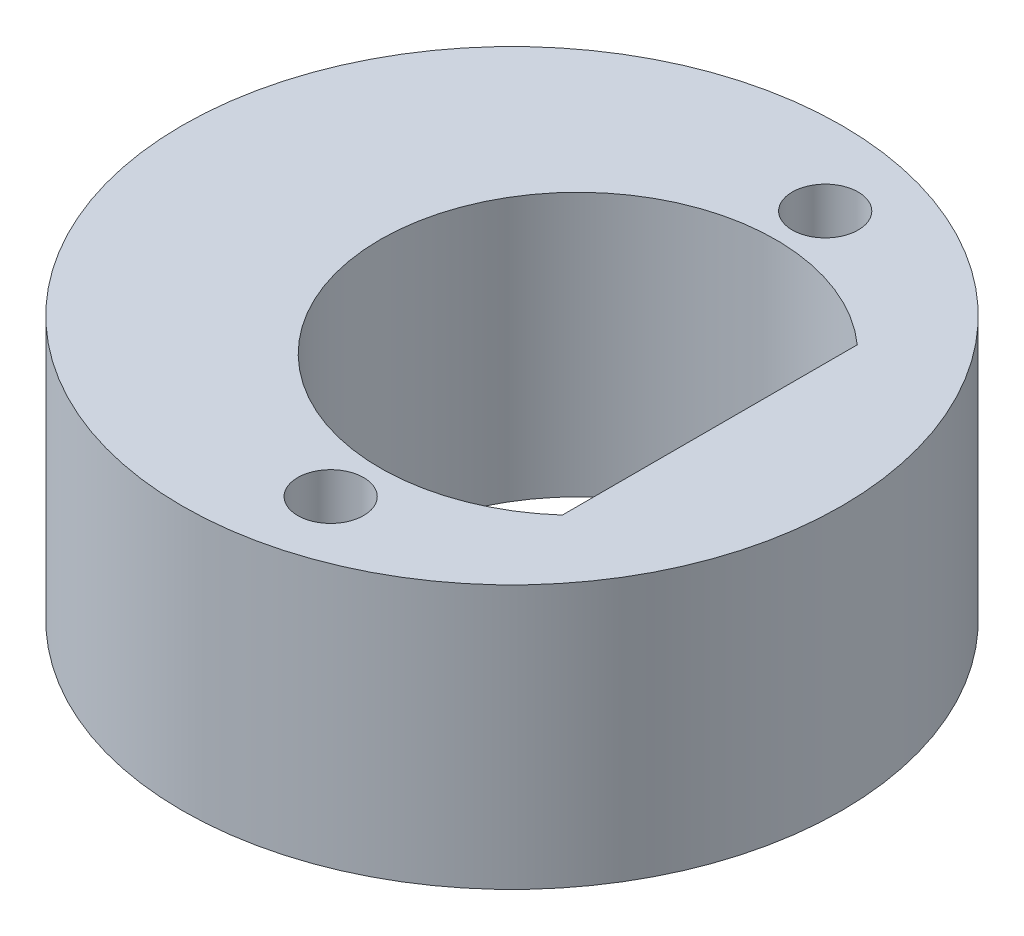
ISO-10303-21;
HEADER;
FILE_DESCRIPTION(('STEP AP214'),'2;1');
FILE_NAME('part.step','',(''),(''),'','','');
FILE_SCHEMA(('AUTOMOTIVE_DESIGN { 1 0 10303 214 1 1 1 1 }'));
ENDSEC;
DATA;
#1=APPLICATION_CONTEXT('core data for automotive mechanical design processes');
#2=APPLICATION_PROTOCOL_DEFINITION('international standard','automotive_design',2000,#1);
#3=PRODUCT_CONTEXT('',#1,'mechanical');
#4=PRODUCT('Part','Part','',(#3));
#5=PRODUCT_RELATED_PRODUCT_CATEGORY('part','',(#4));
#6=PRODUCT_DEFINITION_FORMATION('','',#4);
#7=PRODUCT_DEFINITION_CONTEXT('part definition',#1,'design');
#8=PRODUCT_DEFINITION('design','',#6,#7);
#9=PRODUCT_DEFINITION_SHAPE('','',#8);
#10=(LENGTH_UNIT() NAMED_UNIT(*) SI_UNIT(.MILLI.,.METRE.));
#11=(NAMED_UNIT(*) PLANE_ANGLE_UNIT() SI_UNIT($,.RADIAN.));
#12=(NAMED_UNIT(*) SI_UNIT($,.STERADIAN.) SOLID_ANGLE_UNIT());
#13=UNCERTAINTY_MEASURE_WITH_UNIT(LENGTH_MEASURE(1.E-05),#10,'distance_accuracy_value','');
#14=(GEOMETRIC_REPRESENTATION_CONTEXT(3) GLOBAL_UNCERTAINTY_ASSIGNED_CONTEXT((#13)) GLOBAL_UNIT_ASSIGNED_CONTEXT((#10,
#11,#12)) REPRESENTATION_CONTEXT('',''));
#15=CARTESIAN_POINT('',(0.,0.,0.));
#16=DIRECTION('',(0.,0.,1.));
#17=DIRECTION('',(1.,0.,0.));
#18=AXIS2_PLACEMENT_3D('',#15,#16,#17);
#19=CARTESIAN_POINT('',(-1.,4.,0.));
#20=DIRECTION('',(0.,1.,0.));
#21=DIRECTION('',(0.,0.,1.));
#22=AXIS2_PLACEMENT_3D('',#19,#20,#21);
#23=PLANE('',#22);
#24=CARTESIAN_POINT('',(0.,4.,-3.75));
#25=DIRECTION('',(0.,1.,0.));
#26=DIRECTION('',(0.,0.,1.));
#27=AXIS2_PLACEMENT_3D('',#24,#25,#26);
#28=CIRCLE('',#27,0.5);
#29=CARTESIAN_POINT('',(0.,4.,-3.25));
#30=VERTEX_POINT('',#29);
#31=EDGE_CURVE('E81',#30,#30,#28,.T.);
#32=ORIENTED_EDGE('',*,*,#31,.F.);
#33=EDGE_LOOP('',(#32));
#34=FACE_BOUND('',#33,.T.);
#35=CARTESIAN_POINT('',(0.,4.,3.75));
#36=DIRECTION('',(0.,1.,0.));
#37=DIRECTION('',(0.,0.,1.));
#38=AXIS2_PLACEMENT_3D('',#35,#36,#37);
#39=CIRCLE('',#38,0.5);
#40=CARTESIAN_POINT('',(0.,4.,4.25));
#41=VERTEX_POINT('',#40);
#42=EDGE_CURVE('E84',#41,#41,#39,.T.);
#43=ORIENTED_EDGE('',*,*,#42,.F.);
#44=EDGE_LOOP('',(#43));
#45=FACE_BOUND('',#44,.T.);
#46=CARTESIAN_POINT('',(-1.,4.,0.));
#47=DIRECTION('',(0.,1.,0.));
#48=DIRECTION('',(0.,0.,1.));
#49=AXIS2_PLACEMENT_3D('',#46,#47,#48);
#50=CIRCLE('',#49,5.);
#51=CARTESIAN_POINT('',(-1.,4.,5.));
#52=VERTEX_POINT('',#51);
#53=EDGE_CURVE('E11',#52,#52,#50,.T.);
#54=ORIENTED_EDGE('',*,*,#53,.T.);
#55=EDGE_LOOP('',(#54));
#56=FACE_BOUND('',#55,.T.);
#57=CARTESIAN_POINT('',(0.,4.,0.));
#58=DIRECTION('',(0.,1.,0.));
#59=DIRECTION('',(0.,0.,1.));
#60=AXIS2_PLACEMENT_3D('',#57,#58,#59);
#61=CIRCLE('',#60,3.);
#62=CARTESIAN_POINT('',(2.,4.,-2.23606797749979));
#63=VERTEX_POINT('',#62);
#64=CARTESIAN_POINT('',(2.,4.,2.23606797749979));
#65=VERTEX_POINT('',#64);
#66=EDGE_CURVE('E74',#63,#65,#61,.T.);
#67=ORIENTED_EDGE('',*,*,#66,.F.);
#68=DIRECTION('',(0.,0.,-1.));
#69=VECTOR('',#68,1.);
#70=CARTESIAN_POINT('',(2.,4.,0.));
#71=LINE('',#70,#69);
#72=EDGE_CURVE('E59',#65,#63,#71,.T.);
#73=ORIENTED_EDGE('',*,*,#72,.F.);
#74=EDGE_LOOP('',(#67,#73));
#75=FACE_BOUND('',#74,.T.);
#76=ADVANCED_FACE('F37',(#34,#45,#56,#75),#23,.T.);
#77=CARTESIAN_POINT('',(-1.,0.,0.));
#78=DIRECTION('',(0.,1.,0.));
#79=DIRECTION('',(0.,0.,1.));
#80=AXIS2_PLACEMENT_3D('',#77,#78,#79);
#81=PLANE('',#80);
#82=CARTESIAN_POINT('',(0.,0.,-3.75));
#83=DIRECTION('',(0.,1.,0.));
#84=DIRECTION('',(0.,0.,1.));
#85=AXIS2_PLACEMENT_3D('',#82,#83,#84);
#86=CIRCLE('',#85,0.5);
#87=CARTESIAN_POINT('',(0.,0.,-3.25));
#88=VERTEX_POINT('',#87);
#89=EDGE_CURVE('E77',#88,#88,#86,.T.);
#90=ORIENTED_EDGE('',*,*,#89,.T.);
#91=EDGE_LOOP('',(#90));
#92=FACE_BOUND('',#91,.T.);
#93=CARTESIAN_POINT('',(0.,0.,3.75));
#94=DIRECTION('',(0.,1.,0.));
#95=DIRECTION('',(0.,0.,1.));
#96=AXIS2_PLACEMENT_3D('',#93,#94,#95);
#97=CIRCLE('',#96,0.5);
#98=CARTESIAN_POINT('',(0.,0.,4.25));
#99=VERTEX_POINT('',#98);
#100=EDGE_CURVE('E87',#99,#99,#97,.T.);
#101=ORIENTED_EDGE('',*,*,#100,.T.);
#102=EDGE_LOOP('',(#101));
#103=FACE_BOUND('',#102,.T.);
#104=CARTESIAN_POINT('',(-1.,0.,0.));
#105=DIRECTION('',(0.,1.,0.));
#106=DIRECTION('',(0.,0.,1.));
#107=AXIS2_PLACEMENT_3D('',#104,#105,#106);
#108=CIRCLE('',#107,5.);
#109=CARTESIAN_POINT('',(-1.,0.,5.));
#110=VERTEX_POINT('',#109);
#111=EDGE_CURVE('E41',#110,#110,#108,.T.);
#112=ORIENTED_EDGE('',*,*,#111,.F.);
#113=EDGE_LOOP('',(#112));
#114=FACE_BOUND('',#113,.T.);
#115=CARTESIAN_POINT('',(0.,0.,0.));
#116=DIRECTION('',(0.,1.,0.));
#117=DIRECTION('',(0.,0.,1.));
#118=AXIS2_PLACEMENT_3D('',#115,#116,#117);
#119=CIRCLE('',#118,3.);
#120=CARTESIAN_POINT('',(2.,0.,-2.23606797749979));
#121=VERTEX_POINT('',#120);
#122=CARTESIAN_POINT('',(2.,0.,2.23606797749979));
#123=VERTEX_POINT('',#122);
#124=EDGE_CURVE('E72',#121,#123,#119,.T.);
#125=ORIENTED_EDGE('',*,*,#124,.T.);
#126=DIRECTION('',(0.,0.,-1.));
#127=VECTOR('',#126,1.);
#128=CARTESIAN_POINT('',(2.,0.,0.));
#129=LINE('',#128,#127);
#130=EDGE_CURVE('E51',#123,#121,#129,.T.);
#131=ORIENTED_EDGE('',*,*,#130,.T.);
#132=EDGE_LOOP('',(#125,#131));
#133=FACE_BOUND('',#132,.T.);
#134=ADVANCED_FACE('F76',(#92,#103,#114,#133),#81,.F.);
#135=CARTESIAN_POINT('',(-1.,4.,0.));
#136=DIRECTION('',(0.,-1.,0.));
#137=DIRECTION('',(0.,0.,-1.));
#138=AXIS2_PLACEMENT_3D('',#135,#136,#137);
#139=CYLINDRICAL_SURFACE('',#138,5.);
#140=ORIENTED_EDGE('',*,*,#53,.F.);
#141=EDGE_LOOP('',(#140));
#142=FACE_BOUND('',#141,.T.);
#143=ORIENTED_EDGE('',*,*,#111,.T.);
#144=EDGE_LOOP('',(#143));
#145=FACE_BOUND('',#144,.T.);
#146=ADVANCED_FACE('F39',(#142,#145),#139,.T.);
#147=CARTESIAN_POINT('',(0.,4.,0.));
#148=DIRECTION('',(0.,-1.,0.));
#149=DIRECTION('',(0.,0.,-1.));
#150=AXIS2_PLACEMENT_3D('',#147,#148,#149);
#151=CYLINDRICAL_SURFACE('',#150,3.);
#152=DIRECTION('',(0.,-1.,0.));
#153=VECTOR('',#152,1.);
#154=CARTESIAN_POINT('',(2.,4.,-2.23606797749979));
#155=LINE('',#154,#153);
#156=EDGE_CURVE('E66',#63,#121,#155,.T.);
#157=ORIENTED_EDGE('',*,*,#156,.F.);
#158=ORIENTED_EDGE('',*,*,#66,.T.);
#159=DIRECTION('',(0.,-1.,0.));
#160=VECTOR('',#159,1.);
#161=CARTESIAN_POINT('',(2.,4.,2.23606797749979));
#162=LINE('',#161,#160);
#163=EDGE_CURVE('E65',#65,#123,#162,.T.);
#164=ORIENTED_EDGE('',*,*,#163,.T.);
#165=ORIENTED_EDGE('',*,*,#124,.F.);
#166=EDGE_LOOP('',(#157,#158,#164,#165));
#167=FACE_BOUND('',#166,.T.);
#168=ADVANCED_FACE('F71',(#167),#151,.F.);
#169=CARTESIAN_POINT('',(0.,0.,3.75));
#170=DIRECTION('',(0.,1.,0.));
#171=DIRECTION('',(0.,0.,1.));
#172=AXIS2_PLACEMENT_3D('',#169,#170,#171);
#173=CYLINDRICAL_SURFACE('',#172,0.5);
#174=ORIENTED_EDGE('',*,*,#100,.F.);
#175=EDGE_LOOP('',(#174));
#176=FACE_BOUND('',#175,.T.);
#177=ORIENTED_EDGE('',*,*,#42,.T.);
#178=EDGE_LOOP('',(#177));
#179=FACE_BOUND('',#178,.T.);
#180=ADVANCED_FACE('F119',(#176,#179),#173,.F.);
#181=CARTESIAN_POINT('',(0.,0.,-3.75));
#182=DIRECTION('',(0.,1.,0.));
#183=DIRECTION('',(0.,0.,1.));
#184=AXIS2_PLACEMENT_3D('',#181,#182,#183);
#185=CYLINDRICAL_SURFACE('',#184,0.5);
#186=ORIENTED_EDGE('',*,*,#89,.F.);
#187=EDGE_LOOP('',(#186));
#188=FACE_BOUND('',#187,.T.);
#189=ORIENTED_EDGE('',*,*,#31,.T.);
#190=EDGE_LOOP('',(#189));
#191=FACE_BOUND('',#190,.T.);
#192=ADVANCED_FACE('F95',(#188,#191),#185,.F.);
#193=CARTESIAN_POINT('',(2.,4.,0.));
#194=DIRECTION('',(-1.,0.,0.));
#195=DIRECTION('',(0.,0.,1.));
#196=AXIS2_PLACEMENT_3D('',#193,#194,#195);
#197=PLANE('',#196);
#198=ORIENTED_EDGE('',*,*,#130,.F.);
#199=ORIENTED_EDGE('',*,*,#163,.F.);
#200=ORIENTED_EDGE('',*,*,#72,.T.);
#201=ORIENTED_EDGE('',*,*,#156,.T.);
#202=EDGE_LOOP('',(#198,#199,#200,#201));
#203=FACE_BOUND('',#202,.T.);
#204=ADVANCED_FACE('F64',(#203),#197,.T.);
#205=CLOSED_SHELL('',(#76,#134,#146,#168,#180,#192,#204));
#206=MANIFOLD_SOLID_BREP('B2',#205);
#207=ADVANCED_BREP_SHAPE_REPRESENTATION('',(#18,#206),#14);
#208=SHAPE_DEFINITION_REPRESENTATION(#9,#207);
ENDSEC;
END-ISO-10303-21;
